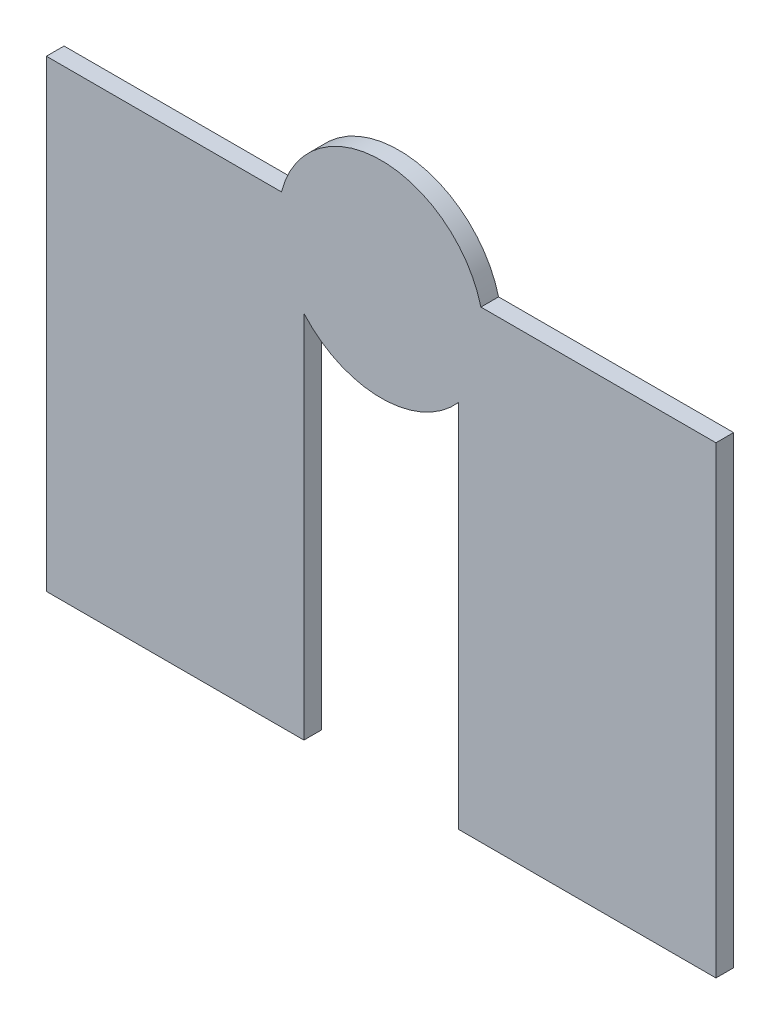
ISO-10303-21;
HEADER;
FILE_DESCRIPTION(('STEP AP214'),'2;1');
FILE_NAME('part.step','',(''),(''),'','','');
FILE_SCHEMA(('AUTOMOTIVE_DESIGN { 1 0 10303 214 1 1 1 1 }'));
ENDSEC;
DATA;
#1=APPLICATION_CONTEXT('core data for automotive mechanical design processes');
#2=APPLICATION_PROTOCOL_DEFINITION('international standard','automotive_design',2000,#1);
#3=PRODUCT_CONTEXT('',#1,'mechanical');
#4=PRODUCT('Part','Part','',(#3));
#5=PRODUCT_RELATED_PRODUCT_CATEGORY('part','',(#4));
#6=PRODUCT_DEFINITION_FORMATION('','',#4);
#7=PRODUCT_DEFINITION_CONTEXT('part definition',#1,'design');
#8=PRODUCT_DEFINITION('design','',#6,#7);
#9=PRODUCT_DEFINITION_SHAPE('','',#8);
#10=(LENGTH_UNIT() NAMED_UNIT(*) SI_UNIT(.MILLI.,.METRE.));
#11=(NAMED_UNIT(*) PLANE_ANGLE_UNIT() SI_UNIT($,.RADIAN.));
#12=(NAMED_UNIT(*) SI_UNIT($,.STERADIAN.) SOLID_ANGLE_UNIT());
#13=UNCERTAINTY_MEASURE_WITH_UNIT(LENGTH_MEASURE(1.E-05),#10,'distance_accuracy_value','');
#14=(GEOMETRIC_REPRESENTATION_CONTEXT(3) GLOBAL_UNCERTAINTY_ASSIGNED_CONTEXT((#13)) GLOBAL_UNIT_ASSIGNED_CONTEXT((#10,
#11,#12)) REPRESENTATION_CONTEXT('',''));
#15=CARTESIAN_POINT('',(0.,0.,0.));
#16=DIRECTION('',(0.,0.,1.));
#17=DIRECTION('',(1.,0.,0.));
#18=AXIS2_PLACEMENT_3D('',#15,#16,#17);
#19=CARTESIAN_POINT('',(7.000080000091,10.531653179753,0.));
#20=DIRECTION('',(0.,0.,-1.));
#21=DIRECTION('',(-1.,0.,0.));
#22=AXIS2_PLACEMENT_3D('',#19,#20,#21);
#23=PLANE('',#22);
#24=DIRECTION('',(1.,0.,0.));
#25=VECTOR('',#24,1.);
#26=CARTESIAN_POINT('',(7.193754643,10.95,0.));
#27=LINE('',#26,#25);
#28=CARTESIAN_POINT('',(7.19375464300022,10.95,0.));
#29=VERTEX_POINT('',#28);
#30=CARTESIAN_POINT('',(7.65008,10.95,0.));
#31=VERTEX_POINT('',#30);
#32=EDGE_CURVE('E64',#29,#31,#27,.T.);
#33=ORIENTED_EDGE('',*,*,#32,.T.);
#34=DIRECTION('',(0.,1.,0.));
#35=VECTOR('',#34,1.);
#36=CARTESIAN_POINT('',(7.65008,10.95,0.));
#37=LINE('',#36,#35);
#38=CARTESIAN_POINT('',(7.65008,10.05,0.));
#39=VERTEX_POINT('',#38);
#40=EDGE_CURVE('E84',#31,#39,#37,.F.);
#41=ORIENTED_EDGE('',*,*,#40,.T.);
#42=DIRECTION('',(1.,0.,0.));
#43=VECTOR('',#42,1.);
#44=CARTESIAN_POINT('',(7.65008,10.05,0.));
#45=LINE('',#44,#43);
#46=CARTESIAN_POINT('',(7.15008,10.05,0.));
#47=VERTEX_POINT('',#46);
#48=EDGE_CURVE('E79',#39,#47,#45,.F.);
#49=ORIENTED_EDGE('',*,*,#48,.T.);
#50=DIRECTION('',(0.,1.,0.));
#51=VECTOR('',#50,1.);
#52=CARTESIAN_POINT('',(7.15008,10.05,0.));
#53=LINE('',#52,#51);
#54=CARTESIAN_POINT('',(7.15008,10.7676751440001,0.));
#55=VERTEX_POINT('',#54);
#56=EDGE_CURVE('E83',#47,#55,#53,.T.);
#57=ORIENTED_EDGE('',*,*,#56,.T.);
#58=CARTESIAN_POINT('',(7.00008,10.899999999596,0.));
#59=DIRECTION('',(0.,0.,1.));
#60=DIRECTION('',(1.,0.,0.));
#61=AXIS2_PLACEMENT_3D('',#58,#59,#60);
#62=CIRCLE('',#61,0.200024667);
#63=CARTESIAN_POINT('',(6.85008000000004,10.7676751440001,0.));
#64=VERTEX_POINT('',#63);
#65=EDGE_CURVE('E96',#64,#55,#62,.T.);
#66=ORIENTED_EDGE('',*,*,#65,.F.);
#67=DIRECTION('',(0.,-1.,0.));
#68=VECTOR('',#67,1.);
#69=CARTESIAN_POINT('',(6.85008,10.767675144,0.));
#70=LINE('',#69,#68);
#71=CARTESIAN_POINT('',(6.85008,10.05,0.));
#72=VERTEX_POINT('',#71);
#73=EDGE_CURVE('E109',#64,#72,#70,.T.);
#74=ORIENTED_EDGE('',*,*,#73,.T.);
#75=DIRECTION('',(1.,0.,0.));
#76=VECTOR('',#75,1.);
#77=CARTESIAN_POINT('',(6.85008,10.05,0.));
#78=LINE('',#77,#76);
#79=CARTESIAN_POINT('',(6.35008,10.05,0.));
#80=VERTEX_POINT('',#79);
#81=EDGE_CURVE('E116',#72,#80,#78,.F.);
#82=ORIENTED_EDGE('',*,*,#81,.T.);
#83=DIRECTION('',(0.,1.,0.));
#84=VECTOR('',#83,1.);
#85=CARTESIAN_POINT('',(6.35008,10.05,0.));
#86=LINE('',#85,#84);
#87=CARTESIAN_POINT('',(6.35008,10.95,0.));
#88=VERTEX_POINT('',#87);
#89=EDGE_CURVE('E122',#80,#88,#86,.T.);
#90=ORIENTED_EDGE('',*,*,#89,.T.);
#91=DIRECTION('',(1.,8.76568009468E-09,0.));
#92=VECTOR('',#91,1.);
#93=CARTESIAN_POINT('',(6.35008,10.95,0.));
#94=LINE('',#93,#92);
#95=CARTESIAN_POINT('',(6.80640535800022,10.950000004,0.));
#96=VERTEX_POINT('',#95);
#97=EDGE_CURVE('E128',#88,#96,#94,.T.);
#98=ORIENTED_EDGE('',*,*,#97,.T.);
#99=CARTESIAN_POINT('',(7.000079999984,10.89999999939,0.));
#100=DIRECTION('',(0.,0.,1.));
#101=DIRECTION('',(1.,0.,0.));
#102=AXIS2_PLACEMENT_3D('',#99,#100,#101);
#103=CIRCLE('',#102,0.200024667);
#104=EDGE_CURVE('E20',#29,#96,#103,.T.);
#105=ORIENTED_EDGE('',*,*,#104,.F.);
#106=EDGE_LOOP('',(#33,#41,#49,#57,#66,#74,#82,#90,#98,#105));
#107=FACE_BOUND('',#106,.T.);
#108=ADVANCED_FACE('F17',(#107),#23,.T.);
#109=CARTESIAN_POINT('',(7.65008,10.05,0.));
#110=DIRECTION('',(0.,1.,0.));
#111=DIRECTION('',(0.,0.,1.));
#112=AXIS2_PLACEMENT_3D('',#109,#110,#111);
#113=PLANE('',#112);
#114=DIRECTION('',(0.,0.,-1.));
#115=VECTOR('',#114,1.);
#116=CARTESIAN_POINT('',(7.15008,10.05,0.));
#117=LINE('',#116,#115);
#118=CARTESIAN_POINT('',(7.15008,10.05,0.03429));
#119=VERTEX_POINT('',#118);
#120=EDGE_CURVE('E91',#119,#47,#117,.T.);
#121=ORIENTED_EDGE('',*,*,#120,.T.);
#122=ORIENTED_EDGE('',*,*,#48,.F.);
#123=DIRECTION('',(0.,0.,1.));
#124=VECTOR('',#123,1.);
#125=CARTESIAN_POINT('',(7.65008,10.05,0.));
#126=LINE('',#125,#124);
#127=CARTESIAN_POINT('',(7.65008,10.05,0.03429));
#128=VERTEX_POINT('',#127);
#129=EDGE_CURVE('E134',#39,#128,#126,.T.);
#130=ORIENTED_EDGE('',*,*,#129,.T.);
#131=DIRECTION('',(1.,0.,0.));
#132=VECTOR('',#131,1.);
#133=CARTESIAN_POINT('',(7.000080000091,10.05,0.03429));
#134=LINE('',#133,#132);
#135=EDGE_CURVE('E94',#119,#128,#134,.T.);
#136=ORIENTED_EDGE('',*,*,#135,.F.);
#137=EDGE_LOOP('',(#121,#122,#130,#136));
#138=FACE_BOUND('',#137,.T.);
#139=ADVANCED_FACE('F92',(#138),#113,.F.);
#140=CARTESIAN_POINT('',(7.65008,10.95,0.));
#141=DIRECTION('',(-1.,0.,0.));
#142=DIRECTION('',(0.,0.,1.));
#143=AXIS2_PLACEMENT_3D('',#140,#141,#142);
#144=PLANE('',#143);
#145=ORIENTED_EDGE('',*,*,#129,.F.);
#146=ORIENTED_EDGE('',*,*,#40,.F.);
#147=DIRECTION('',(0.,0.,-1.));
#148=VECTOR('',#147,1.);
#149=CARTESIAN_POINT('',(7.65008,10.95,0.));
#150=LINE('',#149,#148);
#151=CARTESIAN_POINT('',(7.65008,10.95,0.03429));
#152=VERTEX_POINT('',#151);
#153=EDGE_CURVE('E133',#31,#152,#150,.F.);
#154=ORIENTED_EDGE('',*,*,#153,.T.);
#155=DIRECTION('',(0.,1.,0.));
#156=VECTOR('',#155,1.);
#157=CARTESIAN_POINT('',(7.65008,10.531653179753,0.03429));
#158=LINE('',#157,#156);
#159=EDGE_CURVE('E184',#128,#152,#158,.T.);
#160=ORIENTED_EDGE('',*,*,#159,.F.);
#161=EDGE_LOOP('',(#145,#146,#154,#160));
#162=FACE_BOUND('',#161,.T.);
#163=ADVANCED_FACE('F190',(#162),#144,.F.);
#164=CARTESIAN_POINT('',(7.193754643,10.95,0.));
#165=DIRECTION('',(0.,-1.,0.));
#166=DIRECTION('',(0.,0.,-1.));
#167=AXIS2_PLACEMENT_3D('',#164,#165,#166);
#168=PLANE('',#167);
#169=ORIENTED_EDGE('',*,*,#153,.F.);
#170=ORIENTED_EDGE('',*,*,#32,.F.);
#171=DIRECTION('',(0.,0.,1.));
#172=VECTOR('',#171,1.);
#173=CARTESIAN_POINT('',(7.19375464300021,10.9500000000001,0.));
#174=LINE('',#173,#172);
#175=CARTESIAN_POINT('',(7.19375464300022,10.95,0.03429));
#176=VERTEX_POINT('',#175);
#177=EDGE_CURVE('E177',#176,#29,#174,.F.);
#178=ORIENTED_EDGE('',*,*,#177,.F.);
#179=DIRECTION('',(1.,0.,0.));
#180=VECTOR('',#179,1.);
#181=CARTESIAN_POINT('',(7.000080000091,10.95,0.03429));
#182=LINE('',#181,#180);
#183=EDGE_CURVE('E146',#152,#176,#182,.F.);
#184=ORIENTED_EDGE('',*,*,#183,.F.);
#185=EDGE_LOOP('',(#169,#170,#178,#184));
#186=FACE_BOUND('',#185,.T.);
#187=ADVANCED_FACE('F241',(#186),#168,.F.);
#188=CARTESIAN_POINT('',(7.000079999984,10.89999999939,0.));
#189=DIRECTION('',(0.,0.,1.));
#190=DIRECTION('',(1.,0.,0.));
#191=AXIS2_PLACEMENT_3D('',#188,#189,#190);
#192=CYLINDRICAL_SURFACE('',#191,0.200024667);
#193=ORIENTED_EDGE('',*,*,#104,.T.);
#194=DIRECTION('',(0.,0.,1.));
#195=VECTOR('',#194,1.);
#196=CARTESIAN_POINT('',(6.806405358,10.950000004,0.));
#197=LINE('',#196,#195);
#198=CARTESIAN_POINT('',(6.80640535800022,10.950000004,0.03429));
#199=VERTEX_POINT('',#198);
#200=EDGE_CURVE('E125',#96,#199,#197,.T.);
#201=ORIENTED_EDGE('',*,*,#200,.T.);
#202=CARTESIAN_POINT('',(7.000079999984,10.89999999939,0.03429));
#203=DIRECTION('',(0.,0.,1.));
#204=DIRECTION('',(1.,0.,0.));
#205=AXIS2_PLACEMENT_3D('',#202,#203,#204);
#206=CIRCLE('',#205,0.200024667);
#207=EDGE_CURVE('E143',#176,#199,#206,.T.);
#208=ORIENTED_EDGE('',*,*,#207,.F.);
#209=ORIENTED_EDGE('',*,*,#177,.T.);
#210=EDGE_LOOP('',(#193,#201,#208,#209));
#211=FACE_BOUND('',#210,.T.);
#212=ADVANCED_FACE('F240',(#211),#192,.T.);
#213=CARTESIAN_POINT('',(6.35008,10.95,0.));
#214=DIRECTION('',(8.76568009468E-09,-1.,0.));
#215=DIRECTION('',(1.,8.76568009468E-09,0.));
#216=AXIS2_PLACEMENT_3D('',#213,#214,#215);
#217=PLANE('',#216);
#218=ORIENTED_EDGE('',*,*,#200,.F.);
#219=ORIENTED_EDGE('',*,*,#97,.F.);
#220=DIRECTION('',(0.,0.,-1.));
#221=VECTOR('',#220,1.);
#222=CARTESIAN_POINT('',(6.35008,10.95,0.));
#223=LINE('',#222,#221);
#224=CARTESIAN_POINT('',(6.35008,10.9500000026667,0.03429));
#225=VERTEX_POINT('',#224);
#226=EDGE_CURVE('E119',#88,#225,#223,.F.);
#227=ORIENTED_EDGE('',*,*,#226,.T.);
#228=DIRECTION('',(1.,0.,0.));
#229=VECTOR('',#228,1.);
#230=CARTESIAN_POINT('',(7.000080000091,10.950000004,0.03429));
#231=LINE('',#230,#229);
#232=EDGE_CURVE('E145',#199,#225,#231,.F.);
#233=ORIENTED_EDGE('',*,*,#232,.F.);
#234=EDGE_LOOP('',(#218,#219,#227,#233));
#235=FACE_BOUND('',#234,.T.);
#236=ADVANCED_FACE('F234',(#235),#217,.F.);
#237=CARTESIAN_POINT('',(6.35008,10.05,0.));
#238=DIRECTION('',(1.,0.,0.));
#239=DIRECTION('',(0.,0.,-1.));
#240=AXIS2_PLACEMENT_3D('',#237,#238,#239);
#241=PLANE('',#240);
#242=ORIENTED_EDGE('',*,*,#226,.F.);
#243=ORIENTED_EDGE('',*,*,#89,.F.);
#244=DIRECTION('',(0.,0.,1.));
#245=VECTOR('',#244,1.);
#246=CARTESIAN_POINT('',(6.35008,10.05,0.));
#247=LINE('',#246,#245);
#248=CARTESIAN_POINT('',(6.35008,10.05,0.03429));
#249=VERTEX_POINT('',#248);
#250=EDGE_CURVE('E113',#80,#249,#247,.T.);
#251=ORIENTED_EDGE('',*,*,#250,.T.);
#252=DIRECTION('',(0.,1.,0.));
#253=VECTOR('',#252,1.);
#254=CARTESIAN_POINT('',(6.35008,10.531653179753,0.03429));
#255=LINE('',#254,#253);
#256=EDGE_CURVE('E161',#225,#249,#255,.F.);
#257=ORIENTED_EDGE('',*,*,#256,.F.);
#258=EDGE_LOOP('',(#242,#243,#251,#257));
#259=FACE_BOUND('',#258,.T.);
#260=ADVANCED_FACE('F237',(#259),#241,.F.);
#261=CARTESIAN_POINT('',(6.85008,10.05,0.));
#262=DIRECTION('',(0.,1.,0.));
#263=DIRECTION('',(0.,0.,1.));
#264=AXIS2_PLACEMENT_3D('',#261,#262,#263);
#265=PLANE('',#264);
#266=ORIENTED_EDGE('',*,*,#250,.F.);
#267=ORIENTED_EDGE('',*,*,#81,.F.);
#268=DIRECTION('',(0.,0.,1.));
#269=VECTOR('',#268,1.);
#270=CARTESIAN_POINT('',(6.85008,10.05,0.));
#271=LINE('',#270,#269);
#272=CARTESIAN_POINT('',(6.85008,10.05,0.03429));
#273=VERTEX_POINT('',#272);
#274=EDGE_CURVE('E112',#72,#273,#271,.T.);
#275=ORIENTED_EDGE('',*,*,#274,.T.);
#276=DIRECTION('',(1.,0.,0.));
#277=VECTOR('',#276,1.);
#278=CARTESIAN_POINT('',(7.000080000091,10.05,0.03429));
#279=LINE('',#278,#277);
#280=EDGE_CURVE('E158',#249,#273,#279,.T.);
#281=ORIENTED_EDGE('',*,*,#280,.F.);
#282=EDGE_LOOP('',(#266,#267,#275,#281));
#283=FACE_BOUND('',#282,.T.);
#284=ADVANCED_FACE('F263',(#283),#265,.F.);
#285=CARTESIAN_POINT('',(6.85008,10.767675144,0.));
#286=DIRECTION('',(-1.,0.,0.));
#287=DIRECTION('',(0.,-1.,0.));
#288=AXIS2_PLACEMENT_3D('',#285,#286,#287);
#289=PLANE('',#288);
#290=ORIENTED_EDGE('',*,*,#274,.F.);
#291=ORIENTED_EDGE('',*,*,#73,.F.);
#292=DIRECTION('',(0.,0.,1.));
#293=VECTOR('',#292,1.);
#294=CARTESIAN_POINT('',(6.85008000000008,10.7676751440001,0.));
#295=LINE('',#294,#293);
#296=CARTESIAN_POINT('',(6.85008000000004,10.7676751440001,0.03429));
#297=VERTEX_POINT('',#296);
#298=EDGE_CURVE('E147',#297,#64,#295,.F.);
#299=ORIENTED_EDGE('',*,*,#298,.F.);
#300=DIRECTION('',(0.,1.,0.));
#301=VECTOR('',#300,1.);
#302=CARTESIAN_POINT('',(6.85008,10.531653179753,0.03429));
#303=LINE('',#302,#301);
#304=EDGE_CURVE('E142',#273,#297,#303,.T.);
#305=ORIENTED_EDGE('',*,*,#304,.F.);
#306=EDGE_LOOP('',(#290,#291,#299,#305));
#307=FACE_BOUND('',#306,.T.);
#308=ADVANCED_FACE('F214',(#307),#289,.F.);
#309=CARTESIAN_POINT('',(7.00008,10.899999999596,0.));
#310=DIRECTION('',(0.,0.,1.));
#311=DIRECTION('',(1.,0.,0.));
#312=AXIS2_PLACEMENT_3D('',#309,#310,#311);
#313=CYLINDRICAL_SURFACE('',#312,0.200024667);
#314=ORIENTED_EDGE('',*,*,#65,.T.);
#315=DIRECTION('',(0.,0.,-1.));
#316=VECTOR('',#315,1.);
#317=CARTESIAN_POINT('',(7.15008,10.767675144,0.));
#318=LINE('',#317,#316);
#319=CARTESIAN_POINT('',(7.15008,10.7676751440001,0.03429));
#320=VERTEX_POINT('',#319);
#321=EDGE_CURVE('E35',#55,#320,#318,.F.);
#322=ORIENTED_EDGE('',*,*,#321,.T.);
#323=CARTESIAN_POINT('',(7.00008,10.899999999596,0.03429));
#324=DIRECTION('',(0.,0.,1.));
#325=DIRECTION('',(1.,0.,0.));
#326=AXIS2_PLACEMENT_3D('',#323,#324,#325);
#327=CIRCLE('',#326,0.200024667);
#328=EDGE_CURVE('E26',#297,#320,#327,.T.);
#329=ORIENTED_EDGE('',*,*,#328,.F.);
#330=ORIENTED_EDGE('',*,*,#298,.T.);
#331=EDGE_LOOP('',(#314,#322,#329,#330));
#332=FACE_BOUND('',#331,.T.);
#333=ADVANCED_FACE('F256',(#332),#313,.T.);
#334=CARTESIAN_POINT('',(7.15008,10.05,0.));
#335=DIRECTION('',(1.,0.,0.));
#336=DIRECTION('',(0.,0.,-1.));
#337=AXIS2_PLACEMENT_3D('',#334,#335,#336);
#338=PLANE('',#337);
#339=ORIENTED_EDGE('',*,*,#321,.F.);
#340=ORIENTED_EDGE('',*,*,#56,.F.);
#341=ORIENTED_EDGE('',*,*,#120,.F.);
#342=DIRECTION('',(0.,1.,0.));
#343=VECTOR('',#342,1.);
#344=CARTESIAN_POINT('',(7.15008,10.531653179753,0.03429));
#345=LINE('',#344,#343);
#346=EDGE_CURVE('E11',#320,#119,#345,.F.);
#347=ORIENTED_EDGE('',*,*,#346,.F.);
#348=EDGE_LOOP('',(#339,#340,#341,#347));
#349=FACE_BOUND('',#348,.T.);
#350=ADVANCED_FACE('F98',(#349),#338,.F.);
#351=CARTESIAN_POINT('',(7.000080000091,10.531653179753,0.03429));
#352=DIRECTION('',(0.,0.,1.));
#353=DIRECTION('',(1.,0.,0.));
#354=AXIS2_PLACEMENT_3D('',#351,#352,#353);
#355=PLANE('',#354);
#356=ORIENTED_EDGE('',*,*,#328,.T.);
#357=ORIENTED_EDGE('',*,*,#346,.T.);
#358=ORIENTED_EDGE('',*,*,#135,.T.);
#359=ORIENTED_EDGE('',*,*,#159,.T.);
#360=ORIENTED_EDGE('',*,*,#183,.T.);
#361=ORIENTED_EDGE('',*,*,#207,.T.);
#362=ORIENTED_EDGE('',*,*,#232,.T.);
#363=ORIENTED_EDGE('',*,*,#256,.T.);
#364=ORIENTED_EDGE('',*,*,#280,.T.);
#365=ORIENTED_EDGE('',*,*,#304,.T.);
#366=EDGE_LOOP('',(#356,#357,#358,#359,#360,#361,#362,#363,#364,#365));
#367=FACE_BOUND('',#366,.T.);
#368=ADVANCED_FACE('F194',(#367),#355,.T.);
#369=CLOSED_SHELL('',(#108,#139,#163,#187,#212,#236,#260,#284,#308,#333,#350,#368));
#370=MANIFOLD_SOLID_BREP('B1',#369);
#371=ADVANCED_BREP_SHAPE_REPRESENTATION('',(#18,#370),#14);
#372=SHAPE_DEFINITION_REPRESENTATION(#9,#371);
ENDSEC;
END-ISO-10303-21;
